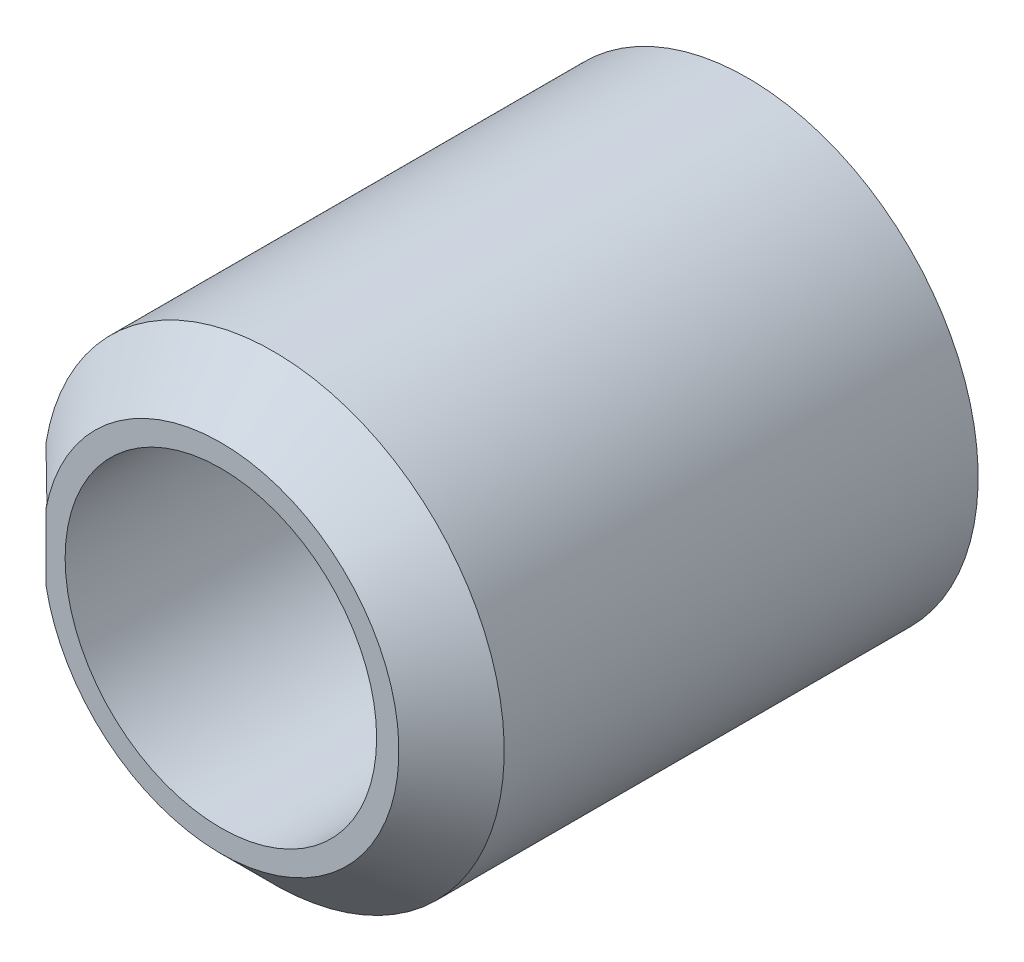
ISO-10303-21;
HEADER;
FILE_DESCRIPTION(('STEP AP214'),'2;1');
FILE_NAME('part.step','',(''),(''),'','','');
FILE_SCHEMA(('AUTOMOTIVE_DESIGN { 1 0 10303 214 1 1 1 1 }'));
ENDSEC;
DATA;
#1=APPLICATION_CONTEXT('core data for automotive mechanical design processes');
#2=APPLICATION_PROTOCOL_DEFINITION('international standard','automotive_design',2000,#1);
#3=PRODUCT_CONTEXT('',#1,'mechanical');
#4=PRODUCT('Part','Part','',(#3));
#5=PRODUCT_RELATED_PRODUCT_CATEGORY('part','',(#4));
#6=PRODUCT_DEFINITION_FORMATION('','',#4);
#7=PRODUCT_DEFINITION_CONTEXT('part definition',#1,'design');
#8=PRODUCT_DEFINITION('design','',#6,#7);
#9=PRODUCT_DEFINITION_SHAPE('','',#8);
#10=(LENGTH_UNIT() NAMED_UNIT(*) SI_UNIT(.MILLI.,.METRE.));
#11=(NAMED_UNIT(*) PLANE_ANGLE_UNIT() SI_UNIT($,.RADIAN.));
#12=(NAMED_UNIT(*) SI_UNIT($,.STERADIAN.) SOLID_ANGLE_UNIT());
#13=UNCERTAINTY_MEASURE_WITH_UNIT(LENGTH_MEASURE(1.E-05),#10,'distance_accuracy_value','');
#14=(GEOMETRIC_REPRESENTATION_CONTEXT(3) GLOBAL_UNCERTAINTY_ASSIGNED_CONTEXT((#13)) GLOBAL_UNIT_ASSIGNED_CONTEXT((#10,
#11,#12)) REPRESENTATION_CONTEXT('',''));
#15=CARTESIAN_POINT('',(0.,0.,0.));
#16=DIRECTION('',(0.,0.,1.));
#17=DIRECTION('',(1.,0.,0.));
#18=AXIS2_PLACEMENT_3D('',#15,#16,#17);
#19=CARTESIAN_POINT('',(-0.411497685913132,0.,15.99));
#20=DIRECTION('',(0.,0.,1.));
#21=DIRECTION('',(1.,0.,0.));
#22=AXIS2_PLACEMENT_3D('',#19,#20,#21);
#23=PLANE('',#22);
#24=CARTESIAN_POINT('',(0.,0.,15.99));
#25=DIRECTION('',(0.,0.,1.));
#26=DIRECTION('',(0.,-1.,0.));
#27=AXIS2_PLACEMENT_3D('',#24,#25,#26);
#28=CIRCLE('',#27,2.1);
#29=CARTESIAN_POINT('',(0.,-2.1,15.99));
#30=VERTEX_POINT('',#29);
#31=EDGE_CURVE('E19',#30,#30,#28,.F.);
#32=ORIENTED_EDGE('',*,*,#31,.T.);
#33=EDGE_LOOP('',(#32));
#34=FACE_BOUND('',#33,.T.);
#35=CARTESIAN_POINT('',(0.,0.,15.9900000002722));
#36=DIRECTION('',(0.,0.,-1.));
#37=DIRECTION('',(0.,1.,0.));
#38=AXIS2_PLACEMENT_3D('',#35,#36,#37);
#39=CIRCLE('',#38,2.40000000028963);
#40=CARTESIAN_POINT('',(-2.35789830339924,0.447566299971763,15.9900000001361));
#41=VERTEX_POINT('',#40);
#42=CARTESIAN_POINT('',(-2.35789830339924,-0.447566299251985,15.9900000002703));
#43=VERTEX_POINT('',#42);
#44=EDGE_CURVE('E143',#41,#43,#39,.T.);
#45=ORIENTED_EDGE('',*,*,#44,.F.);
#46=DIRECTION('',(0.,1.,0.));
#47=VECTOR('',#46,1.);
#48=CARTESIAN_POINT('',(-2.35789830339924,-0.51,15.99));
#49=LINE('',#48,#47);
#50=EDGE_CURVE('E106',#43,#41,#49,.T.);
#51=ORIENTED_EDGE('',*,*,#50,.F.);
#52=EDGE_LOOP('',(#45,#51));
#53=FACE_BOUND('',#52,.T.);
#54=ADVANCED_FACE('F16',(#34,#53),#23,.T.);
#55=CARTESIAN_POINT('',(0.,0.,8.89));
#56=DIRECTION('',(0.,0.,1.));
#57=DIRECTION('',(0.,-1.,0.));
#58=AXIS2_PLACEMENT_3D('',#55,#56,#57);
#59=CYLINDRICAL_SURFACE('',#58,2.1);
#60=CARTESIAN_POINT('',(0.,0.,8.89));
#61=DIRECTION('',(0.,0.,1.));
#62=DIRECTION('',(0.,-1.,0.));
#63=AXIS2_PLACEMENT_3D('',#60,#61,#62);
#64=CIRCLE('',#63,2.1);
#65=CARTESIAN_POINT('',(0.,-2.1,8.89));
#66=VERTEX_POINT('',#65);
#67=EDGE_CURVE('E83',#66,#66,#64,.F.);
#68=ORIENTED_EDGE('',*,*,#67,.T.);
#69=EDGE_LOOP('',(#68));
#70=FACE_BOUND('',#69,.T.);
#71=ORIENTED_EDGE('',*,*,#31,.F.);
#72=EDGE_LOOP('',(#71));
#73=FACE_BOUND('',#72,.T.);
#74=ADVANCED_FACE('F152',(#70,#73),#59,.F.);
#75=CARTESIAN_POINT('',(-2.35789830339924,-0.51,8.89));
#76=DIRECTION('',(-1.,0.,0.));
#77=DIRECTION('',(0.,0.,1.));
#78=AXIS2_PLACEMENT_3D('',#75,#76,#77);
#79=PLANE('',#78);
#80=DIRECTION('',(0.,1.,0.));
#81=VECTOR('',#80,1.);
#82=CARTESIAN_POINT('',(-2.35789830339925,0.,8.89));
#83=LINE('',#82,#81);
#84=CARTESIAN_POINT('',(-2.35789830339925,0.51,8.89));
#85=VERTEX_POINT('',#84);
#86=CARTESIAN_POINT('',(-2.35789830339925,-0.51,8.89));
#87=VERTEX_POINT('',#86);
#88=EDGE_CURVE('E64',#85,#87,#83,.F.);
#89=ORIENTED_EDGE('',*,*,#88,.T.);
#90=DIRECTION('',(0.,0.,1.));
#91=VECTOR('',#90,1.);
#92=CARTESIAN_POINT('',(-2.35789830339924,-0.51,8.89));
#93=LINE('',#92,#91);
#94=CARTESIAN_POINT('',(-2.35789830339924,-0.510000000055241,15.9775770672162));
#95=VERTEX_POINT('',#94);
#96=EDGE_CURVE('E68',#95,#87,#93,.F.);
#97=ORIENTED_EDGE('',*,*,#96,.F.);
#98=CARTESIAN_POINT('',(-2.35789830336033,-0.447566297799421,15.9900000005244));
#99=CARTESIAN_POINT('',(-2.35789830337979,-0.457996732120375,15.9880542302797));
#100=CARTESIAN_POINT('',(-2.35789830339276,-0.468414758287973,15.9860461006123));
#101=CARTESIAN_POINT('',(-2.35789830340573,-0.489225992386923,15.9819051228159));
#102=CARTESIAN_POINT('',(-2.35789830340573,-0.499619200322875,15.97977227471));
#103=CARTESIAN_POINT('',(-2.35789830339924,-0.510000000110074,15.9775770672046));
#104=B_SPLINE_CURVE_WITH_KNOTS('',3,(#98,#99,#100,#101,#102,#103),.UNSPECIFIED.,.F.,.F.,(4,2,4),
(0.,0.0318293997101694,0.0636587935181396),.UNSPECIFIED.);
#105=EDGE_CURVE('E132',#43,#95,#104,.T.);
#106=ORIENTED_EDGE('',*,*,#105,.F.);
#107=ORIENTED_EDGE('',*,*,#50,.T.);
#108=CARTESIAN_POINT('',(-2.35789830335844,0.510000000106874,15.9775770671874));
#109=CARTESIAN_POINT('',(-2.35789830337884,0.499619200319831,15.979772274699));
#110=CARTESIAN_POINT('',(-2.35789830339244,0.489225992383969,15.9819051228107));
#111=CARTESIAN_POINT('',(-2.35789830340604,0.468414758285137,15.9860461006186));
#112=CARTESIAN_POINT('',(-2.35789830340604,0.457996732117564,15.9880542302916));
#113=CARTESIAN_POINT('',(-2.35789830339924,0.447566297796571,15.9900000005417));
#114=B_SPLINE_CURVE_WITH_KNOTS('',3,(#108,#109,#110,#111,#112,#113),.UNSPECIFIED.,.F.,.F.,(4,2,
4),(0.,0.0318293938112675,0.0636587935245304),.UNSPECIFIED.);
#115=CARTESIAN_POINT('',(-2.35789830352126,0.51000000005524,15.9775770670969));
#116=VERTEX_POINT('',#115);
#117=EDGE_CURVE('E59',#116,#41,#114,.T.);
#118=ORIENTED_EDGE('',*,*,#117,.F.);
#119=DIRECTION('',(0.,0.,-1.));
#120=VECTOR('',#119,1.);
#121=CARTESIAN_POINT('',(-2.35789830339925,0.51,8.89));
#122=LINE('',#121,#120);
#123=EDGE_CURVE('E71',#85,#116,#122,.F.);
#124=ORIENTED_EDGE('',*,*,#123,.F.);
#125=EDGE_LOOP('',(#89,#97,#106,#107,#118,#124));
#126=FACE_BOUND('',#125,.T.);
#127=ADVANCED_FACE('F66',(#126),#79,.T.);
#128=CARTESIAN_POINT('',(0.,0.,15.2799999997342));
#129=DIRECTION('',(0.,0.,-1.));
#130=DIRECTION('',(0.,1.,0.));
#131=AXIS2_PLACEMENT_3D('',#128,#129,#130);
#132=CONICAL_SURFACE('',#131,3.10999999961321,0.785398162542219);
#133=ORIENTED_EDGE('',*,*,#44,.T.);
#134=ORIENTED_EDGE('',*,*,#105,.T.);
#135=CARTESIAN_POINT('',(-3.06789830317695,-0.510000000166361,15.2799999997747));
#136=CARTESIAN_POINT('',(-3.00884821183327,-0.510000000060075,15.3382499765102));
#137=CARTESIAN_POINT('',(-2.94977621862576,-0.510000000016174,15.3964777677938));
#138=CARTESIAN_POINT('',(-2.83157823965616,-0.509999999983826,15.5128783679806));
#139=CARTESIAN_POINT('',(-2.77245225396399,-0.509999999995379,15.5710511769548));
#140=CARTESIAN_POINT('',(-2.65413592197519,-0.510000000004621,15.6873313778507));
#141=CARTESIAN_POINT('',(-2.59494557564968,-0.510000000002311,15.745438769743));
#142=CARTESIAN_POINT('',(-2.47648535041965,-0.50999999999769,15.8615725744789));
#143=CARTESIAN_POINT('',(-2.41721547141198,-0.509999999995379,15.9195989872173));
#144=CARTESIAN_POINT('',(-2.3578983036435,-0.51,15.9775770669891));
#145=B_SPLINE_CURVE_WITH_KNOTS('',3,(#135,#136,#137,#138,#139,#140,#141,#142,#143,#144),
.UNSPECIFIED.,.F.,.F.,(4,2,2,2,4),(0.,0.248836820531275,0.49767331928412,0.746509929743959,
0.995346863267727),.UNSPECIFIED.);
#146=CARTESIAN_POINT('',(-3.06789830323611,-0.51,15.2799999998346));
#147=VERTEX_POINT('',#146);
#148=EDGE_CURVE('E78',#147,#95,#145,.T.);
#149=ORIENTED_EDGE('',*,*,#148,.F.);
#150=CARTESIAN_POINT('',(0.,0.,15.28));
#151=DIRECTION('',(0.,0.,1.));
#152=DIRECTION('',(0.,-1.,0.));
#153=AXIS2_PLACEMENT_3D('',#150,#151,#152);
#154=CIRCLE('',#153,3.11);
#155=CARTESIAN_POINT('',(-3.06789830323611,0.51,15.2799999998346));
#156=VERTEX_POINT('',#155);
#157=EDGE_CURVE('E92',#156,#147,#154,.F.);
#158=ORIENTED_EDGE('',*,*,#157,.F.);
#159=CARTESIAN_POINT('',(-2.35789830359722,0.509999999923381,15.9775770669422));
#160=CARTESIAN_POINT('',(-2.4172154713981,0.509999999972332,15.9195989872034));
#161=CARTESIAN_POINT('',(-2.47648535041656,0.509999999992551,15.8615725744759));
#162=CARTESIAN_POINT('',(-2.59494557565276,0.510000000007449,15.7454387697461));
#163=CARTESIAN_POINT('',(-2.65413592197365,0.510000000002128,15.687331377849));
#164=CARTESIAN_POINT('',(-2.77245225396574,0.509999999997872,15.5710511769563));
#165=CARTESIAN_POINT('',(-2.83157823966582,0.509999999998936,15.51287836799));
#166=CARTESIAN_POINT('',(-2.9497762186166,0.510000000001064,15.3964777677839));
#167=CARTESIAN_POINT('',(-3.00884821179739,0.510000000002128,15.3382499764731));
#168=CARTESIAN_POINT('',(-3.06789830307346,0.51,15.2799999996688));
#169=B_SPLINE_CURVE_WITH_KNOTS('',3,(#159,#160,#161,#162,#163,#164,#165,#166,#167,#168),
.UNSPECIFIED.,.F.,.F.,(4,2,2,2,4),(0.,0.24883693352403,0.497673543984004,0.746510042737034,
0.995346863268601),.UNSPECIFIED.);
#170=EDGE_CURVE('E86',#116,#156,#169,.T.);
#171=ORIENTED_EDGE('',*,*,#170,.F.);
#172=ORIENTED_EDGE('',*,*,#117,.T.);
#173=EDGE_LOOP('',(#133,#134,#149,#158,#171,#172));
#174=FACE_BOUND('',#173,.T.);
#175=ADVANCED_FACE('F121',(#174),#132,.T.);
#176=CARTESIAN_POINT('',(-3.06789830339925,-0.51,8.89));
#177=DIRECTION('',(0.,1.,0.));
#178=DIRECTION('',(0.,0.,1.));
#179=AXIS2_PLACEMENT_3D('',#176,#177,#178);
#180=PLANE('',#179);
#181=DIRECTION('',(1.,0.,0.));
#182=VECTOR('',#181,1.);
#183=CARTESIAN_POINT('',(-0.411497685913132,-0.51,8.89));
#184=LINE('',#183,#182);
#185=CARTESIAN_POINT('',(-3.06789830339925,-0.509999999999999,8.89));
#186=VERTEX_POINT('',#185);
#187=EDGE_CURVE('E73',#87,#186,#184,.F.);
#188=ORIENTED_EDGE('',*,*,#187,.T.);
#189=DIRECTION('',(0.,0.,1.));
#190=VECTOR('',#189,1.);
#191=CARTESIAN_POINT('',(-3.06789830339925,-0.509999999999998,8.89));
#192=LINE('',#191,#190);
#193=EDGE_CURVE('E91',#147,#186,#192,.F.);
#194=ORIENTED_EDGE('',*,*,#193,.F.);
#195=ORIENTED_EDGE('',*,*,#148,.T.);
#196=ORIENTED_EDGE('',*,*,#96,.T.);
#197=EDGE_LOOP('',(#188,#194,#195,#196));
#198=FACE_BOUND('',#197,.T.);
#199=ADVANCED_FACE('F76',(#198),#180,.T.);
#200=CARTESIAN_POINT('',(-0.411497685913132,0.,8.89));
#201=DIRECTION('',(0.,0.,1.));
#202=DIRECTION('',(1.,0.,0.));
#203=AXIS2_PLACEMENT_3D('',#200,#201,#202);
#204=PLANE('',#203);
#205=ORIENTED_EDGE('',*,*,#67,.F.);
#206=EDGE_LOOP('',(#205));
#207=FACE_BOUND('',#206,.T.);
#208=ORIENTED_EDGE('',*,*,#187,.F.);
#209=ORIENTED_EDGE('',*,*,#88,.F.);
#210=DIRECTION('',(1.,0.,0.));
#211=VECTOR('',#210,1.);
#212=CARTESIAN_POINT('',(-2.35789830339925,0.51,8.89));
#213=LINE('',#212,#211);
#214=CARTESIAN_POINT('',(-3.06789830339925,0.510000000000001,8.89));
#215=VERTEX_POINT('',#214);
#216=EDGE_CURVE('E34',#215,#85,#213,.T.);
#217=ORIENTED_EDGE('',*,*,#216,.F.);
#218=CARTESIAN_POINT('',(0.,0.,8.89));
#219=DIRECTION('',(0.,0.,1.));
#220=DIRECTION('',(0.,-1.,0.));
#221=AXIS2_PLACEMENT_3D('',#218,#219,#220);
#222=CIRCLE('',#221,3.11);
#223=EDGE_CURVE('E25',#186,#215,#222,.T.);
#224=ORIENTED_EDGE('',*,*,#223,.F.);
#225=EDGE_LOOP('',(#208,#209,#217,#224));
#226=FACE_BOUND('',#225,.T.);
#227=ADVANCED_FACE('F80',(#207,#226),#204,.F.);
#228=CARTESIAN_POINT('',(-2.35789830339925,0.51,8.89));
#229=DIRECTION('',(0.,-1.,0.));
#230=DIRECTION('',(0.,0.,-1.));
#231=AXIS2_PLACEMENT_3D('',#228,#229,#230);
#232=PLANE('',#231);
#233=ORIENTED_EDGE('',*,*,#216,.T.);
#234=ORIENTED_EDGE('',*,*,#123,.T.);
#235=ORIENTED_EDGE('',*,*,#170,.T.);
#236=DIRECTION('',(0.,0.,1.));
#237=VECTOR('',#236,1.);
#238=CARTESIAN_POINT('',(-3.06789830339925,0.510000000000001,8.89));
#239=LINE('',#238,#237);
#240=EDGE_CURVE('E11',#215,#156,#239,.T.);
#241=ORIENTED_EDGE('',*,*,#240,.F.);
#242=EDGE_LOOP('',(#233,#234,#235,#241));
#243=FACE_BOUND('',#242,.T.);
#244=ADVANCED_FACE('F117',(#243),#232,.T.);
#245=CARTESIAN_POINT('',(0.,0.,8.89));
#246=DIRECTION('',(0.,0.,1.));
#247=DIRECTION('',(0.,-1.,0.));
#248=AXIS2_PLACEMENT_3D('',#245,#246,#247);
#249=CYLINDRICAL_SURFACE('',#248,3.11);
#250=ORIENTED_EDGE('',*,*,#223,.T.);
#251=ORIENTED_EDGE('',*,*,#240,.T.);
#252=ORIENTED_EDGE('',*,*,#157,.T.);
#253=ORIENTED_EDGE('',*,*,#193,.T.);
#254=EDGE_LOOP('',(#250,#251,#252,#253));
#255=FACE_BOUND('',#254,.T.);
#256=ADVANCED_FACE('F160',(#255),#249,.T.);
#257=CLOSED_SHELL('',(#54,#74,#127,#175,#199,#227,#244,#256));
#258=MANIFOLD_SOLID_BREP('B1',#257);
#259=ADVANCED_BREP_SHAPE_REPRESENTATION('',(#18,#258),#14);
#260=SHAPE_DEFINITION_REPRESENTATION(#9,#259);
ENDSEC;
END-ISO-10303-21;
